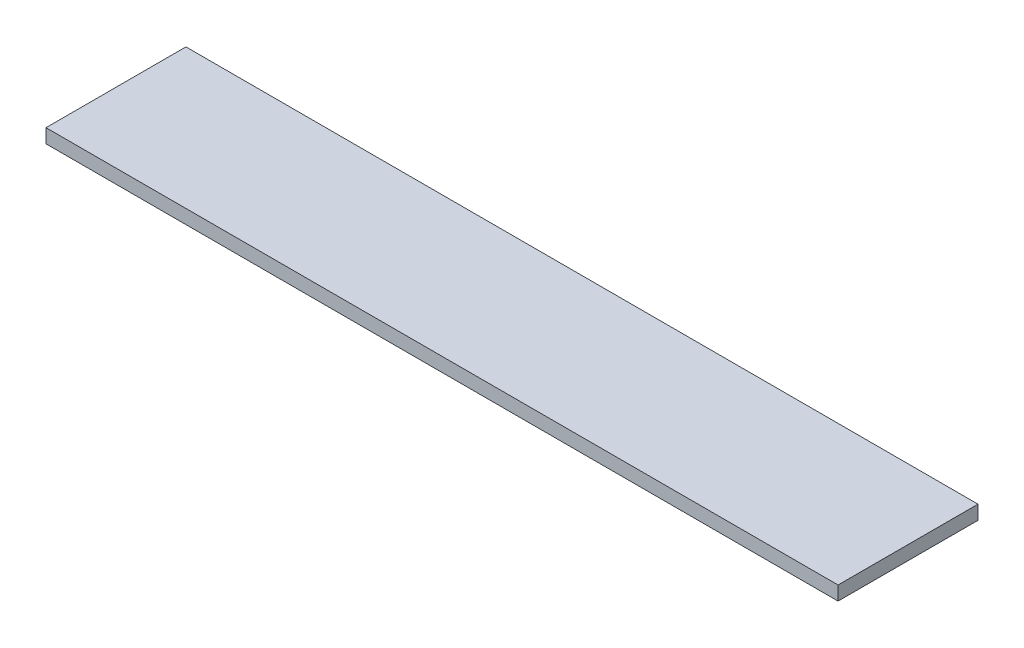
ISO-10303-21;
HEADER;
FILE_DESCRIPTION(('STEP AP214'),'2;1');
FILE_NAME('part.step','',(''),(''),'','','');
FILE_SCHEMA(('AUTOMOTIVE_DESIGN { 1 0 10303 214 1 1 1 1 }'));
ENDSEC;
DATA;
#1=APPLICATION_CONTEXT('core data for automotive mechanical design processes');
#2=APPLICATION_PROTOCOL_DEFINITION('international standard','automotive_design',2000,#1);
#3=PRODUCT_CONTEXT('',#1,'mechanical');
#4=PRODUCT('Part','Part','',(#3));
#5=PRODUCT_RELATED_PRODUCT_CATEGORY('part','',(#4));
#6=PRODUCT_DEFINITION_FORMATION('','',#4);
#7=PRODUCT_DEFINITION_CONTEXT('part definition',#1,'design');
#8=PRODUCT_DEFINITION('design','',#6,#7);
#9=PRODUCT_DEFINITION_SHAPE('','',#8);
#10=(LENGTH_UNIT() NAMED_UNIT(*) SI_UNIT(.MILLI.,.METRE.));
#11=(NAMED_UNIT(*) PLANE_ANGLE_UNIT() SI_UNIT($,.RADIAN.));
#12=(NAMED_UNIT(*) SI_UNIT($,.STERADIAN.) SOLID_ANGLE_UNIT());
#13=UNCERTAINTY_MEASURE_WITH_UNIT(LENGTH_MEASURE(1.E-05),#10,'distance_accuracy_value','');
#14=(GEOMETRIC_REPRESENTATION_CONTEXT(3) GLOBAL_UNCERTAINTY_ASSIGNED_CONTEXT((#13)) GLOBAL_UNIT_ASSIGNED_CONTEXT((#10,
#11,#12)) REPRESENTATION_CONTEXT('',''));
#15=CARTESIAN_POINT('',(0.,0.,0.));
#16=DIRECTION('',(0.,0.,1.));
#17=DIRECTION('',(1.,0.,0.));
#18=AXIS2_PLACEMENT_3D('',#15,#16,#17);
#19=CARTESIAN_POINT('',(0.,10.,0.));
#20=DIRECTION('',(1.,0.,0.));
#21=DIRECTION('',(0.,0.,-1.));
#22=AXIS2_PLACEMENT_3D('',#19,#20,#21);
#23=PLANE('',#22);
#24=DIRECTION('',(0.,0.,1.));
#25=VECTOR('',#24,1.);
#26=CARTESIAN_POINT('',(0.,0.,0.));
#27=LINE('',#26,#25);
#28=CARTESIAN_POINT('',(0.,0.,-100.));
#29=VERTEX_POINT('',#28);
#30=CARTESIAN_POINT('',(0.,0.,0.));
#31=VERTEX_POINT('',#30);
#32=EDGE_CURVE('E94',#29,#31,#27,.T.);
#33=ORIENTED_EDGE('',*,*,#32,.T.);
#34=DIRECTION('',(0.,-1.,0.));
#35=VECTOR('',#34,1.);
#36=CARTESIAN_POINT('',(0.,10.,0.));
#37=LINE('',#36,#35);
#38=CARTESIAN_POINT('',(0.,10.,0.));
#39=VERTEX_POINT('',#38);
#40=EDGE_CURVE('E11',#39,#31,#37,.T.);
#41=ORIENTED_EDGE('',*,*,#40,.F.);
#42=DIRECTION('',(0.,0.,1.));
#43=VECTOR('',#42,1.);
#44=CARTESIAN_POINT('',(0.,10.,0.));
#45=LINE('',#44,#43);
#46=CARTESIAN_POINT('',(0.,10.,-100.));
#47=VERTEX_POINT('',#46);
#48=EDGE_CURVE('E82',#47,#39,#45,.T.);
#49=ORIENTED_EDGE('',*,*,#48,.F.);
#50=DIRECTION('',(0.,-1.,0.));
#51=VECTOR('',#50,1.);
#52=CARTESIAN_POINT('',(0.,10.,-100.));
#53=LINE('',#52,#51);
#54=EDGE_CURVE('E90',#47,#29,#53,.T.);
#55=ORIENTED_EDGE('',*,*,#54,.T.);
#56=EDGE_LOOP('',(#33,#41,#49,#55));
#57=FACE_BOUND('',#56,.T.);
#58=ADVANCED_FACE('F31',(#57),#23,.F.);
#59=CARTESIAN_POINT('',(0.,10.,0.));
#60=DIRECTION('',(0.,0.,-1.));
#61=DIRECTION('',(-1.,0.,0.));
#62=AXIS2_PLACEMENT_3D('',#59,#60,#61);
#63=PLANE('',#62);
#64=DIRECTION('',(1.,0.,0.));
#65=VECTOR('',#64,1.);
#66=CARTESIAN_POINT('',(0.,0.,0.));
#67=LINE('',#66,#65);
#68=CARTESIAN_POINT('',(566.,0.,0.));
#69=VERTEX_POINT('',#68);
#70=EDGE_CURVE('E86',#31,#69,#67,.T.);
#71=ORIENTED_EDGE('',*,*,#70,.T.);
#72=DIRECTION('',(0.,-1.,0.));
#73=VECTOR('',#72,1.);
#74=CARTESIAN_POINT('',(566.,10.,0.));
#75=LINE('',#74,#73);
#76=CARTESIAN_POINT('',(566.,10.,0.));
#77=VERTEX_POINT('',#76);
#78=EDGE_CURVE('E39',#77,#69,#75,.T.);
#79=ORIENTED_EDGE('',*,*,#78,.F.);
#80=DIRECTION('',(1.,0.,0.));
#81=VECTOR('',#80,1.);
#82=CARTESIAN_POINT('',(0.,10.,0.));
#83=LINE('',#82,#81);
#84=EDGE_CURVE('E77',#39,#77,#83,.T.);
#85=ORIENTED_EDGE('',*,*,#84,.F.);
#86=ORIENTED_EDGE('',*,*,#40,.T.);
#87=EDGE_LOOP('',(#71,#79,#85,#86));
#88=FACE_BOUND('',#87,.T.);
#89=ADVANCED_FACE('F85',(#88),#63,.F.);
#90=CARTESIAN_POINT('',(566.,10.,0.));
#91=DIRECTION('',(-1.,0.,0.));
#92=DIRECTION('',(0.,0.,1.));
#93=AXIS2_PLACEMENT_3D('',#90,#91,#92);
#94=PLANE('',#93);
#95=DIRECTION('',(0.,0.,-1.));
#96=VECTOR('',#95,1.);
#97=CARTESIAN_POINT('',(566.,0.,0.));
#98=LINE('',#97,#96);
#99=CARTESIAN_POINT('',(566.,0.,-100.));
#100=VERTEX_POINT('',#99);
#101=EDGE_CURVE('E64',#69,#100,#98,.T.);
#102=ORIENTED_EDGE('',*,*,#101,.T.);
#103=DIRECTION('',(0.,-1.,0.));
#104=VECTOR('',#103,1.);
#105=CARTESIAN_POINT('',(566.,10.,-100.));
#106=LINE('',#105,#104);
#107=CARTESIAN_POINT('',(566.,10.,-100.));
#108=VERTEX_POINT('',#107);
#109=EDGE_CURVE('E87',#108,#100,#106,.T.);
#110=ORIENTED_EDGE('',*,*,#109,.F.);
#111=DIRECTION('',(0.,0.,-1.));
#112=VECTOR('',#111,1.);
#113=CARTESIAN_POINT('',(566.,10.,0.));
#114=LINE('',#113,#112);
#115=EDGE_CURVE('E80',#77,#108,#114,.T.);
#116=ORIENTED_EDGE('',*,*,#115,.F.);
#117=ORIENTED_EDGE('',*,*,#78,.T.);
#118=EDGE_LOOP('',(#102,#110,#116,#117));
#119=FACE_BOUND('',#118,.T.);
#120=ADVANCED_FACE('F88',(#119),#94,.F.);
#121=CARTESIAN_POINT('',(0.,10.,-100.));
#122=DIRECTION('',(0.,0.,1.));
#123=DIRECTION('',(1.,0.,0.));
#124=AXIS2_PLACEMENT_3D('',#121,#122,#123);
#125=PLANE('',#124);
#126=DIRECTION('',(-1.,0.,0.));
#127=VECTOR('',#126,1.);
#128=CARTESIAN_POINT('',(0.,0.,-100.));
#129=LINE('',#128,#127);
#130=EDGE_CURVE('E70',#100,#29,#129,.T.);
#131=ORIENTED_EDGE('',*,*,#130,.T.);
#132=ORIENTED_EDGE('',*,*,#54,.F.);
#133=DIRECTION('',(-1.,0.,0.));
#134=VECTOR('',#133,1.);
#135=CARTESIAN_POINT('',(0.,10.,-100.));
#136=LINE('',#135,#134);
#137=EDGE_CURVE('E47',#108,#47,#136,.T.);
#138=ORIENTED_EDGE('',*,*,#137,.F.);
#139=ORIENTED_EDGE('',*,*,#109,.T.);
#140=EDGE_LOOP('',(#131,#132,#138,#139));
#141=FACE_BOUND('',#140,.T.);
#142=ADVANCED_FACE('F101',(#141),#125,.F.);
#143=CARTESIAN_POINT('',(0.,10.,-100.));
#144=DIRECTION('',(0.,-1.,0.));
#145=DIRECTION('',(0.,0.,-1.));
#146=AXIS2_PLACEMENT_3D('',#143,#144,#145);
#147=PLANE('',#146);
#148=ORIENTED_EDGE('',*,*,#48,.T.);
#149=ORIENTED_EDGE('',*,*,#84,.T.);
#150=ORIENTED_EDGE('',*,*,#115,.T.);
#151=ORIENTED_EDGE('',*,*,#137,.T.);
#152=EDGE_LOOP('',(#148,#149,#150,#151));
#153=FACE_BOUND('',#152,.T.);
#154=ADVANCED_FACE('F78',(#153),#147,.F.);
#155=CARTESIAN_POINT('',(0.,0.,-100.));
#156=DIRECTION('',(0.,-1.,0.));
#157=DIRECTION('',(0.,0.,-1.));
#158=AXIS2_PLACEMENT_3D('',#155,#156,#157);
#159=PLANE('',#158);
#160=ORIENTED_EDGE('',*,*,#32,.F.);
#161=ORIENTED_EDGE('',*,*,#130,.F.);
#162=ORIENTED_EDGE('',*,*,#101,.F.);
#163=ORIENTED_EDGE('',*,*,#70,.F.);
#164=EDGE_LOOP('',(#160,#161,#162,#163));
#165=FACE_BOUND('',#164,.T.);
#166=ADVANCED_FACE('F104',(#165),#159,.T.);
#167=CLOSED_SHELL('',(#58,#89,#120,#142,#154,#166));
#168=MANIFOLD_SOLID_BREP('B2',#167);
#169=ADVANCED_BREP_SHAPE_REPRESENTATION('',(#18,#168),#14);
#170=SHAPE_DEFINITION_REPRESENTATION(#9,#169);
ENDSEC;
END-ISO-10303-21;
